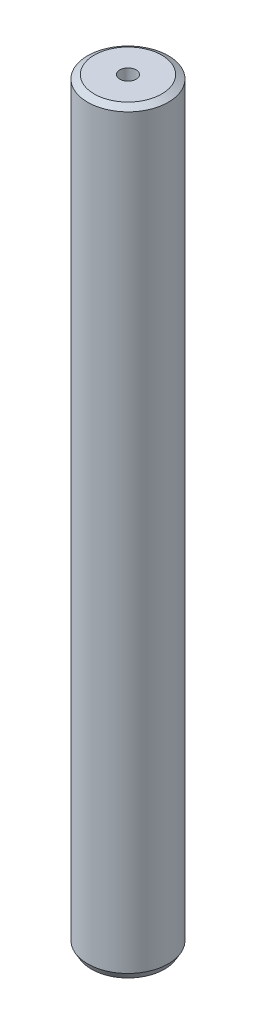
ISO-10303-21;
HEADER;
FILE_DESCRIPTION(('STEP AP214'),'2;1');
FILE_NAME('part.step','',(''),(''),'','','');
FILE_SCHEMA(('AUTOMOTIVE_DESIGN { 1 0 10303 214 1 1 1 1 }'));
ENDSEC;
DATA;
#1=APPLICATION_CONTEXT('core data for automotive mechanical design processes');
#2=APPLICATION_PROTOCOL_DEFINITION('international standard','automotive_design',2000,#1);
#3=PRODUCT_CONTEXT('',#1,'mechanical');
#4=PRODUCT('Part','Part','',(#3));
#5=PRODUCT_RELATED_PRODUCT_CATEGORY('part','',(#4));
#6=PRODUCT_DEFINITION_FORMATION('','',#4);
#7=PRODUCT_DEFINITION_CONTEXT('part definition',#1,'design');
#8=PRODUCT_DEFINITION('design','',#6,#7);
#9=PRODUCT_DEFINITION_SHAPE('','',#8);
#10=(LENGTH_UNIT() NAMED_UNIT(*) SI_UNIT(.MILLI.,.METRE.));
#11=(NAMED_UNIT(*) PLANE_ANGLE_UNIT() SI_UNIT($,.RADIAN.));
#12=(NAMED_UNIT(*) SI_UNIT($,.STERADIAN.) SOLID_ANGLE_UNIT());
#13=UNCERTAINTY_MEASURE_WITH_UNIT(LENGTH_MEASURE(1.E-05),#10,'distance_accuracy_value','');
#14=(GEOMETRIC_REPRESENTATION_CONTEXT(3) GLOBAL_UNCERTAINTY_ASSIGNED_CONTEXT((#13)) GLOBAL_UNIT_ASSIGNED_CONTEXT((#10,
#11,#12)) REPRESENTATION_CONTEXT('',''));
#15=CARTESIAN_POINT('',(0.,0.,0.));
#16=DIRECTION('',(0.,0.,1.));
#17=DIRECTION('',(1.,0.,0.));
#18=AXIS2_PLACEMENT_3D('',#15,#16,#17);
#19=CARTESIAN_POINT('',(0.,93.7448570026077,0.));
#20=DIRECTION('',(0.,-1.,0.));
#21=DIRECTION('',(0.,0.,-1.));
#22=AXIS2_PLACEMENT_3D('',#19,#20,#21);
#23=CYLINDRICAL_SURFACE('',#22,5.);
#24=CARTESIAN_POINT('',(0.,93.2715540630894,0.));
#25=DIRECTION('',(0.,1.,0.));
#26=DIRECTION('',(0.,0.,1.));
#27=AXIS2_PLACEMENT_3D('',#24,#25,#26);
#28=CIRCLE('',#27,5.);
#29=CARTESIAN_POINT('',(0.,93.2715540630894,5.));
#30=VERTEX_POINT('',#29);
#31=EDGE_CURVE('E50',#30,#30,#28,.F.);
#32=ORIENTED_EDGE('',*,*,#31,.T.);
#33=EDGE_LOOP('',(#32));
#34=FACE_BOUND('',#33,.T.);
#35=CARTESIAN_POINT('',(0.,0.819784738617324,0.));
#36=DIRECTION('',(0.,1.,0.));
#37=DIRECTION('',(0.,0.,1.));
#38=AXIS2_PLACEMENT_3D('',#35,#36,#37);
#39=CIRCLE('',#38,5.);
#40=CARTESIAN_POINT('',(0.,0.819784738617324,5.));
#41=VERTEX_POINT('',#40);
#42=EDGE_CURVE('E51',#41,#41,#39,.T.);
#43=ORIENTED_EDGE('',*,*,#42,.T.);
#44=EDGE_LOOP('',(#43));
#45=FACE_BOUND('',#44,.T.);
#46=ADVANCED_FACE('F39',(#34,#45),#23,.T.);
#47=CARTESIAN_POINT('',(0.,93.7448570026077,0.));
#48=DIRECTION('',(0.,1.,0.));
#49=DIRECTION('',(0.,0.,1.));
#50=AXIS2_PLACEMENT_3D('',#47,#48,#49);
#51=PLANE('',#50);
#52=CARTESIAN_POINT('',(0.,93.7448570026077,0.));
#53=DIRECTION('',(0.,1.,0.));
#54=DIRECTION('',(0.,0.,1.));
#55=AXIS2_PLACEMENT_3D('',#52,#53,#54);
#56=CIRCLE('',#55,4.18021526138261);
#57=CARTESIAN_POINT('',(0.,93.7448570026077,4.18021526138261));
#58=VERTEX_POINT('',#57);
#59=EDGE_CURVE('E54',#58,#58,#56,.T.);
#60=ORIENTED_EDGE('',*,*,#59,.T.);
#61=EDGE_LOOP('',(#60));
#62=FACE_BOUND('',#61,.T.);
#63=CARTESIAN_POINT('',(0.,93.7448570026077,0.));
#64=DIRECTION('',(0.,1.,0.));
#65=DIRECTION('',(0.,0.,1.));
#66=AXIS2_PLACEMENT_3D('',#63,#64,#65);
#67=CIRCLE('',#66,1.00831505567068);
#68=CARTESIAN_POINT('',(0.,93.7448570026077,1.00831505567068));
#69=VERTEX_POINT('',#68);
#70=EDGE_CURVE('E58',#69,#69,#67,.T.);
#71=ORIENTED_EDGE('',*,*,#70,.F.);
#72=EDGE_LOOP('',(#71));
#73=FACE_BOUND('',#72,.T.);
#74=ADVANCED_FACE('F69',(#62,#73),#51,.T.);
#75=CARTESIAN_POINT('',(0.,0.,0.));
#76=DIRECTION('',(0.,1.,0.));
#77=DIRECTION('',(0.,0.,1.));
#78=AXIS2_PLACEMENT_3D('',#75,#76,#77);
#79=PLANE('',#78);
#80=CARTESIAN_POINT('',(0.,0.,0.));
#81=DIRECTION('',(0.,1.,0.));
#82=DIRECTION('',(0.,0.,1.));
#83=AXIS2_PLACEMENT_3D('',#80,#81,#82);
#84=CIRCLE('',#83,4.52669706048174);
#85=CARTESIAN_POINT('',(0.,0.,4.52669706048174));
#86=VERTEX_POINT('',#85);
#87=EDGE_CURVE('E10',#86,#86,#84,.F.);
#88=ORIENTED_EDGE('',*,*,#87,.T.);
#89=EDGE_LOOP('',(#88));
#90=FACE_BOUND('',#89,.T.);
#91=CARTESIAN_POINT('',(0.,0.,0.));
#92=DIRECTION('',(0.,1.,0.));
#93=DIRECTION('',(0.,0.,1.));
#94=AXIS2_PLACEMENT_3D('',#91,#92,#93);
#95=CIRCLE('',#94,1.00831505567068);
#96=CARTESIAN_POINT('',(0.,0.,1.00831505567068));
#97=VERTEX_POINT('',#96);
#98=EDGE_CURVE('E63',#97,#97,#95,.T.);
#99=ORIENTED_EDGE('',*,*,#98,.T.);
#100=EDGE_LOOP('',(#99));
#101=FACE_BOUND('',#100,.T.);
#102=ADVANCED_FACE('F75',(#90,#101),#79,.F.);
#103=CARTESIAN_POINT('',(0.,93.7448570026077,0.));
#104=DIRECTION('',(0.,-1.,0.));
#105=DIRECTION('',(0.,0.,-1.));
#106=AXIS2_PLACEMENT_3D('',#103,#104,#105);
#107=CYLINDRICAL_SURFACE('',#106,1.00831505567068);
#108=ORIENTED_EDGE('',*,*,#70,.T.);
#109=EDGE_LOOP('',(#108));
#110=FACE_BOUND('',#109,.T.);
#111=ORIENTED_EDGE('',*,*,#98,.F.);
#112=EDGE_LOOP('',(#111));
#113=FACE_BOUND('',#112,.T.);
#114=ADVANCED_FACE('F70',(#110,#113),#107,.F.);
#115=CARTESIAN_POINT('',(0.,93.7448570026077,0.));
#116=DIRECTION('',(0.,-1.,0.));
#117=DIRECTION('',(0.,0.,-1.));
#118=AXIS2_PLACEMENT_3D('',#115,#116,#117);
#119=CONICAL_SURFACE('',#118,4.18021526138261,1.04719755119659);
#120=ORIENTED_EDGE('',*,*,#31,.F.);
#121=EDGE_LOOP('',(#120));
#122=FACE_BOUND('',#121,.T.);
#123=ORIENTED_EDGE('',*,*,#59,.F.);
#124=EDGE_LOOP('',(#123));
#125=FACE_BOUND('',#124,.T.);
#126=ADVANCED_FACE('F81',(#122,#125),#119,.T.);
#127=CARTESIAN_POINT('',(0.,0.819784738617324,0.));
#128=DIRECTION('',(0.,1.,0.));
#129=DIRECTION('',(0.,0.,1.));
#130=AXIS2_PLACEMENT_3D('',#127,#128,#129);
#131=CONICAL_SURFACE('',#130,5.,0.523598775598299);
#132=ORIENTED_EDGE('',*,*,#87,.F.);
#133=EDGE_LOOP('',(#132));
#134=FACE_BOUND('',#133,.T.);
#135=ORIENTED_EDGE('',*,*,#42,.F.);
#136=EDGE_LOOP('',(#135));
#137=FACE_BOUND('',#136,.T.);
#138=ADVANCED_FACE('F45',(#134,#137),#131,.T.);
#139=CLOSED_SHELL('',(#46,#74,#102,#114,#126,#138));
#140=MANIFOLD_SOLID_BREP('B2',#139);
#141=ADVANCED_BREP_SHAPE_REPRESENTATION('',(#18,#140),#14);
#142=SHAPE_DEFINITION_REPRESENTATION(#9,#141);
ENDSEC;
END-ISO-10303-21;
